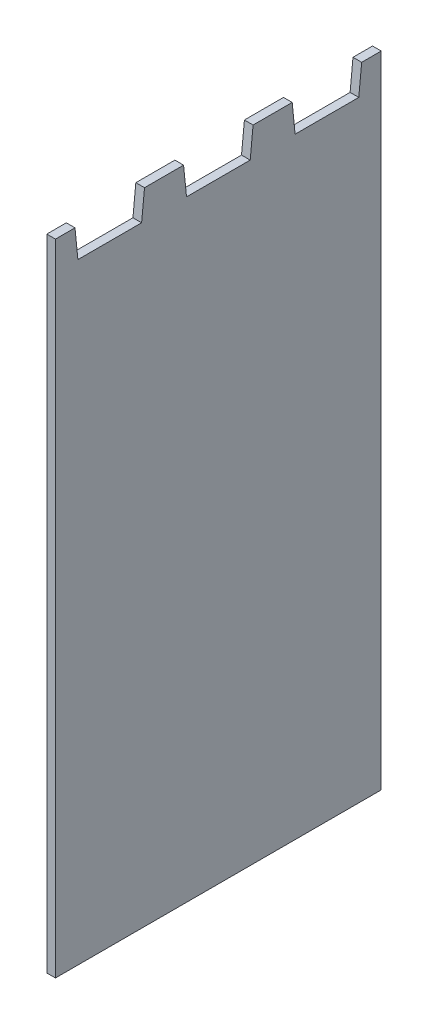
ISO-10303-21;
HEADER;
FILE_DESCRIPTION(('STEP AP214'),'2;1');
FILE_NAME('part.step','',(''),(''),'','','');
FILE_SCHEMA(('AUTOMOTIVE_DESIGN { 1 0 10303 214 1 1 1 1 }'));
ENDSEC;
DATA;
#1=APPLICATION_CONTEXT('core data for automotive mechanical design processes');
#2=APPLICATION_PROTOCOL_DEFINITION('international standard','automotive_design',2000,#1);
#3=PRODUCT_CONTEXT('',#1,'mechanical');
#4=PRODUCT('Part','Part','',(#3));
#5=PRODUCT_RELATED_PRODUCT_CATEGORY('part','',(#4));
#6=PRODUCT_DEFINITION_FORMATION('','',#4);
#7=PRODUCT_DEFINITION_CONTEXT('part definition',#1,'design');
#8=PRODUCT_DEFINITION('design','',#6,#7);
#9=PRODUCT_DEFINITION_SHAPE('','',#8);
#10=(LENGTH_UNIT() NAMED_UNIT(*) SI_UNIT(.MILLI.,.METRE.));
#11=(NAMED_UNIT(*) PLANE_ANGLE_UNIT() SI_UNIT($,.RADIAN.));
#12=(NAMED_UNIT(*) SI_UNIT($,.STERADIAN.) SOLID_ANGLE_UNIT());
#13=UNCERTAINTY_MEASURE_WITH_UNIT(LENGTH_MEASURE(1.E-05),#10,'distance_accuracy_value','');
#14=(GEOMETRIC_REPRESENTATION_CONTEXT(3) GLOBAL_UNCERTAINTY_ASSIGNED_CONTEXT((#13)) GLOBAL_UNIT_ASSIGNED_CONTEXT((#10,
#11,#12)) REPRESENTATION_CONTEXT('',''));
#15=CARTESIAN_POINT('',(0.,0.,0.));
#16=DIRECTION('',(0.,0.,1.));
#17=DIRECTION('',(1.,0.,0.));
#18=AXIS2_PLACEMENT_3D('',#15,#16,#17);
#19=CARTESIAN_POINT('',(3.,-103.,0.));
#20=DIRECTION('',(0.,1.,0.));
#21=DIRECTION('',(0.,0.,1.));
#22=AXIS2_PLACEMENT_3D('',#19,#20,#21);
#23=PLANE('',#22);
#24=DIRECTION('',(0.,0.,-1.));
#25=VECTOR('',#24,1.);
#26=CARTESIAN_POINT('',(0.,-103.,0.));
#27=LINE('',#26,#25);
#28=CARTESIAN_POINT('',(0.,-103.,93.75));
#29=VERTEX_POINT('',#28);
#30=CARTESIAN_POINT('',(0.,-103.,-18.75));
#31=VERTEX_POINT('',#30);
#32=EDGE_CURVE('E124',#29,#31,#27,.T.);
#33=ORIENTED_EDGE('',*,*,#32,.T.);
#34=DIRECTION('',(-1.,0.,0.));
#35=VECTOR('',#34,1.);
#36=CARTESIAN_POINT('',(3.,-103.,-18.75));
#37=LINE('',#36,#35);
#38=CARTESIAN_POINT('',(3.,-103.,-18.75));
#39=VERTEX_POINT('',#38);
#40=EDGE_CURVE('E11',#39,#31,#37,.T.);
#41=ORIENTED_EDGE('',*,*,#40,.F.);
#42=DIRECTION('',(0.,0.,-1.));
#43=VECTOR('',#42,1.);
#44=CARTESIAN_POINT('',(3.,-103.,0.));
#45=LINE('',#44,#43);
#46=CARTESIAN_POINT('',(3.,-103.,93.75));
#47=VERTEX_POINT('',#46);
#48=EDGE_CURVE('E143',#47,#39,#45,.T.);
#49=ORIENTED_EDGE('',*,*,#48,.F.);
#50=DIRECTION('',(-1.,0.,0.));
#51=VECTOR('',#50,1.);
#52=CARTESIAN_POINT('',(3.,-103.,93.75));
#53=LINE('',#52,#51);
#54=EDGE_CURVE('E174',#47,#29,#53,.T.);
#55=ORIENTED_EDGE('',*,*,#54,.T.);
#56=EDGE_LOOP('',(#33,#41,#49,#55));
#57=FACE_BOUND('',#56,.T.);
#58=ADVANCED_FACE('F35',(#57),#23,.F.);
#59=CARTESIAN_POINT('',(3.,0.,-18.75));
#60=DIRECTION('',(0.,0.,1.));
#61=DIRECTION('',(1.,0.,0.));
#62=AXIS2_PLACEMENT_3D('',#59,#60,#61);
#63=PLANE('',#62);
#64=DIRECTION('',(0.,1.,0.));
#65=VECTOR('',#64,1.);
#66=CARTESIAN_POINT('',(0.,0.,-18.75));
#67=LINE('',#66,#65);
#68=CARTESIAN_POINT('',(0.,118.,-18.75));
#69=VERTEX_POINT('',#68);
#70=EDGE_CURVE('E127',#31,#69,#67,.T.);
#71=ORIENTED_EDGE('',*,*,#70,.T.);
#72=DIRECTION('',(-1.,0.,0.));
#73=VECTOR('',#72,1.);
#74=CARTESIAN_POINT('',(3.,118.,-18.75));
#75=LINE('',#74,#73);
#76=CARTESIAN_POINT('',(3.,118.,-18.75));
#77=VERTEX_POINT('',#76);
#78=EDGE_CURVE('E43',#77,#69,#75,.T.);
#79=ORIENTED_EDGE('',*,*,#78,.F.);
#80=DIRECTION('',(0.,1.,0.));
#81=VECTOR('',#80,1.);
#82=CARTESIAN_POINT('',(3.,0.,-18.75));
#83=LINE('',#82,#81);
#84=EDGE_CURVE('E84',#39,#77,#83,.T.);
#85=ORIENTED_EDGE('',*,*,#84,.F.);
#86=ORIENTED_EDGE('',*,*,#40,.T.);
#87=EDGE_LOOP('',(#71,#79,#85,#86));
#88=FACE_BOUND('',#87,.T.);
#89=ADVANCED_FACE('F149',(#88),#63,.F.);
#90=CARTESIAN_POINT('',(3.,118.,0.));
#91=DIRECTION('',(0.,1.,0.));
#92=DIRECTION('',(0.,0.,1.));
#93=AXIS2_PLACEMENT_3D('',#90,#91,#92);
#94=PLANE('',#93);
#95=DIRECTION('',(0.,0.,-1.));
#96=VECTOR('',#95,1.);
#97=CARTESIAN_POINT('',(0.,118.,0.));
#98=LINE('',#97,#96);
#99=CARTESIAN_POINT('',(0.,118.,-12.));
#100=VERTEX_POINT('',#99);
#101=EDGE_CURVE('E131',#100,#69,#98,.T.);
#102=ORIENTED_EDGE('',*,*,#101,.F.);
#103=DIRECTION('',(-1.,0.,0.));
#104=VECTOR('',#103,1.);
#105=CARTESIAN_POINT('',(3.,118.,-12.));
#106=LINE('',#105,#104);
#107=CARTESIAN_POINT('',(3.,118.,-12.));
#108=VERTEX_POINT('',#107);
#109=EDGE_CURVE('E106',#108,#100,#106,.T.);
#110=ORIENTED_EDGE('',*,*,#109,.F.);
#111=DIRECTION('',(0.,0.,-1.));
#112=VECTOR('',#111,1.);
#113=CARTESIAN_POINT('',(3.,118.,0.));
#114=LINE('',#113,#112);
#115=EDGE_CURVE('E114',#108,#77,#114,.T.);
#116=ORIENTED_EDGE('',*,*,#115,.T.);
#117=ORIENTED_EDGE('',*,*,#78,.T.);
#118=EDGE_LOOP('',(#102,#110,#116,#117));
#119=FACE_BOUND('',#118,.T.);
#120=ADVANCED_FACE('F148',(#119),#94,.T.);
#121=CARTESIAN_POINT('',(3.,-0.0198019801980195,-0.198019801980195));
#122=DIRECTION('',(0.,0.0995037190209989,0.995037190209989));
#123=DIRECTION('',(0.,-0.995037190209989,0.0995037190209989));
#124=AXIS2_PLACEMENT_3D('',#121,#122,#123);
#125=PLANE('',#124);
#126=DIRECTION('',(0.,0.995037190209989,-0.0995037190209989));
#127=VECTOR('',#126,1.);
#128=CARTESIAN_POINT('',(0.,-0.0198019801980195,-0.198019801980195));
#129=LINE('',#128,#127);
#130=CARTESIAN_POINT('',(0.,108.,-11.));
#131=VERTEX_POINT('',#130);
#132=EDGE_CURVE('E102',#131,#100,#129,.T.);
#133=ORIENTED_EDGE('',*,*,#132,.F.);
#134=DIRECTION('',(-1.,0.,0.));
#135=VECTOR('',#134,1.);
#136=CARTESIAN_POINT('',(3.,108.,-11.));
#137=LINE('',#136,#135);
#138=CARTESIAN_POINT('',(3.,108.,-11.));
#139=VERTEX_POINT('',#138);
#140=EDGE_CURVE('E97',#139,#131,#137,.T.);
#141=ORIENTED_EDGE('',*,*,#140,.F.);
#142=DIRECTION('',(0.,0.995037190209989,-0.0995037190209989));
#143=VECTOR('',#142,1.);
#144=CARTESIAN_POINT('',(3.,-0.0198019801980195,-0.198019801980195));
#145=LINE('',#144,#143);
#146=EDGE_CURVE('E100',#139,#108,#145,.T.);
#147=ORIENTED_EDGE('',*,*,#146,.T.);
#148=ORIENTED_EDGE('',*,*,#109,.T.);
#149=EDGE_LOOP('',(#133,#141,#147,#148));
#150=FACE_BOUND('',#149,.T.);
#151=ADVANCED_FACE('F99',(#150),#125,.T.);
#152=CARTESIAN_POINT('',(3.,108.,0.));
#153=DIRECTION('',(0.,1.,0.));
#154=DIRECTION('',(0.,0.,1.));
#155=AXIS2_PLACEMENT_3D('',#152,#153,#154);
#156=PLANE('',#155);
#157=DIRECTION('',(0.,0.,-1.));
#158=VECTOR('',#157,1.);
#159=CARTESIAN_POINT('',(0.,108.,0.));
#160=LINE('',#159,#158);
#161=CARTESIAN_POINT('',(0.,108.,11.));
#162=VERTEX_POINT('',#161);
#163=EDGE_CURVE('E135',#162,#131,#160,.T.);
#164=ORIENTED_EDGE('',*,*,#163,.F.);
#165=DIRECTION('',(-1.,0.,0.));
#166=VECTOR('',#165,1.);
#167=CARTESIAN_POINT('',(3.,108.,11.));
#168=LINE('',#167,#166);
#169=CARTESIAN_POINT('',(3.,108.,11.));
#170=VERTEX_POINT('',#169);
#171=EDGE_CURVE('E72',#170,#162,#168,.T.);
#172=ORIENTED_EDGE('',*,*,#171,.F.);
#173=DIRECTION('',(0.,0.,-1.));
#174=VECTOR('',#173,1.);
#175=CARTESIAN_POINT('',(3.,108.,0.));
#176=LINE('',#175,#174);
#177=EDGE_CURVE('E112',#170,#139,#176,.T.);
#178=ORIENTED_EDGE('',*,*,#177,.T.);
#179=ORIENTED_EDGE('',*,*,#140,.T.);
#180=EDGE_LOOP('',(#164,#172,#178,#179));
#181=FACE_BOUND('',#180,.T.);
#182=ADVANCED_FACE('F116',(#181),#156,.T.);
#183=CARTESIAN_POINT('',(3.,-0.0198019801980129,0.198019801980127));
#184=DIRECTION('',(0.,0.0995037190209996,-0.995037190209989));
#185=DIRECTION('',(0.,0.995037190209989,0.0995037190209996));
#186=AXIS2_PLACEMENT_3D('',#183,#184,#185);
#187=PLANE('',#186);
#188=DIRECTION('',(0.,-0.995037190209989,-0.0995037190209996));
#189=VECTOR('',#188,1.);
#190=CARTESIAN_POINT('',(0.,-0.0198019801980129,0.198019801980127));
#191=LINE('',#190,#189);
#192=CARTESIAN_POINT('',(0.,118.,12.));
#193=VERTEX_POINT('',#192);
#194=EDGE_CURVE('E137',#193,#162,#191,.T.);
#195=ORIENTED_EDGE('',*,*,#194,.F.);
#196=DIRECTION('',(-1.,0.,0.));
#197=VECTOR('',#196,1.);
#198=CARTESIAN_POINT('',(3.,118.,12.));
#199=LINE('',#198,#197);
#200=CARTESIAN_POINT('',(3.,118.,12.));
#201=VERTEX_POINT('',#200);
#202=EDGE_CURVE('E51',#201,#193,#199,.T.);
#203=ORIENTED_EDGE('',*,*,#202,.F.);
#204=DIRECTION('',(0.,-0.995037190209989,-0.0995037190209996));
#205=VECTOR('',#204,1.);
#206=CARTESIAN_POINT('',(3.,-0.0198019801980129,0.198019801980127));
#207=LINE('',#206,#205);
#208=EDGE_CURVE('E117',#201,#170,#207,.T.);
#209=ORIENTED_EDGE('',*,*,#208,.T.);
#210=ORIENTED_EDGE('',*,*,#171,.T.);
#211=EDGE_LOOP('',(#195,#203,#209,#210));
#212=FACE_BOUND('',#211,.T.);
#213=ADVANCED_FACE('F155',(#212),#187,.T.);
#214=CARTESIAN_POINT('',(3.,118.,0.));
#215=DIRECTION('',(0.,1.,0.));
#216=DIRECTION('',(0.,0.,1.));
#217=AXIS2_PLACEMENT_3D('',#214,#215,#216);
#218=PLANE('',#217);
#219=DIRECTION('',(0.,0.,-1.));
#220=VECTOR('',#219,1.);
#221=CARTESIAN_POINT('',(0.,118.,0.));
#222=LINE('',#221,#220);
#223=CARTESIAN_POINT('',(0.,118.,25.5));
#224=VERTEX_POINT('',#223);
#225=EDGE_CURVE('E140',#224,#193,#222,.T.);
#226=ORIENTED_EDGE('',*,*,#225,.F.);
#227=DIRECTION('',(-1.,0.,0.));
#228=VECTOR('',#227,1.);
#229=CARTESIAN_POINT('',(3.,118.,25.5));
#230=LINE('',#229,#228);
#231=CARTESIAN_POINT('',(3.,118.,25.5));
#232=VERTEX_POINT('',#231);
#233=EDGE_CURVE('E128',#232,#224,#230,.T.);
#234=ORIENTED_EDGE('',*,*,#233,.F.);
#235=DIRECTION('',(0.,0.,-1.));
#236=VECTOR('',#235,1.);
#237=CARTESIAN_POINT('',(3.,118.,0.));
#238=LINE('',#237,#236);
#239=EDGE_CURVE('E119',#232,#201,#238,.T.);
#240=ORIENTED_EDGE('',*,*,#239,.T.);
#241=ORIENTED_EDGE('',*,*,#202,.T.);
#242=EDGE_LOOP('',(#226,#234,#240,#241));
#243=FACE_BOUND('',#242,.T.);
#244=ADVANCED_FACE('F157',(#243),#218,.T.);
#245=CARTESIAN_POINT('',(3.,0.,0.));
#246=DIRECTION('',(1.,0.,0.));
#247=DIRECTION('',(0.,0.,-1.));
#248=AXIS2_PLACEMENT_3D('',#245,#246,#247);
#249=PLANE('',#248);
#250=ORIENTED_EDGE('',*,*,#48,.T.);
#251=ORIENTED_EDGE('',*,*,#84,.T.);
#252=ORIENTED_EDGE('',*,*,#115,.F.);
#253=ORIENTED_EDGE('',*,*,#146,.F.);
#254=ORIENTED_EDGE('',*,*,#177,.F.);
#255=ORIENTED_EDGE('',*,*,#208,.F.);
#256=ORIENTED_EDGE('',*,*,#239,.F.);
#257=DIRECTION('',(0.,0.995037190209989,-0.0995037190209989));
#258=VECTOR('',#257,1.);
#259=CARTESIAN_POINT('',(3.,-0.0198019801980195,37.3019801980198));
#260=LINE('',#259,#258);
#261=CARTESIAN_POINT('',(3.,108.,26.5));
#262=VERTEX_POINT('',#261);
#263=EDGE_CURVE('E237',#262,#232,#260,.T.);
#264=ORIENTED_EDGE('',*,*,#263,.F.);
#265=DIRECTION('',(0.,0.,-1.));
#266=VECTOR('',#265,1.);
#267=CARTESIAN_POINT('',(3.,108.,37.5));
#268=LINE('',#267,#266);
#269=CARTESIAN_POINT('',(3.,108.,48.5));
#270=VERTEX_POINT('',#269);
#271=EDGE_CURVE('E240',#270,#262,#268,.T.);
#272=ORIENTED_EDGE('',*,*,#271,.F.);
#273=DIRECTION('',(0.,-0.995037190209989,-0.0995037190209996));
#274=VECTOR('',#273,1.);
#275=CARTESIAN_POINT('',(3.,-0.0198019801980129,37.6980198019801));
#276=LINE('',#275,#274);
#277=CARTESIAN_POINT('',(3.,118.,49.5));
#278=VERTEX_POINT('',#277);
#279=EDGE_CURVE('E280',#278,#270,#276,.T.);
#280=ORIENTED_EDGE('',*,*,#279,.F.);
#281=DIRECTION('',(0.,0.,-1.));
#282=VECTOR('',#281,1.);
#283=CARTESIAN_POINT('',(3.,118.,37.5));
#284=LINE('',#283,#282);
#285=CARTESIAN_POINT('',(3.,118.,63.));
#286=VERTEX_POINT('',#285);
#287=EDGE_CURVE('E224',#286,#278,#284,.T.);
#288=ORIENTED_EDGE('',*,*,#287,.F.);
#289=DIRECTION('',(0.,0.995037190209989,-0.0995037190209989));
#290=VECTOR('',#289,1.);
#291=CARTESIAN_POINT('',(3.,-0.0198019801980195,74.8019801980198));
#292=LINE('',#291,#290);
#293=CARTESIAN_POINT('',(3.,108.,64.));
#294=VERTEX_POINT('',#293);
#295=EDGE_CURVE('E294',#294,#286,#292,.T.);
#296=ORIENTED_EDGE('',*,*,#295,.F.);
#297=DIRECTION('',(0.,0.,-1.));
#298=VECTOR('',#297,1.);
#299=CARTESIAN_POINT('',(3.,108.,75.));
#300=LINE('',#299,#298);
#301=CARTESIAN_POINT('',(3.,108.,86.));
#302=VERTEX_POINT('',#301);
#303=EDGE_CURVE('E299',#302,#294,#300,.T.);
#304=ORIENTED_EDGE('',*,*,#303,.F.);
#305=DIRECTION('',(0.,-0.995037190209989,-0.0995037190209996));
#306=VECTOR('',#305,1.);
#307=CARTESIAN_POINT('',(3.,-0.0198019801980129,75.1980198019801));
#308=LINE('',#307,#306);
#309=CARTESIAN_POINT('',(3.,118.,87.));
#310=VERTEX_POINT('',#309);
#311=EDGE_CURVE('E301',#310,#302,#308,.T.);
#312=ORIENTED_EDGE('',*,*,#311,.F.);
#313=DIRECTION('',(0.,0.,-1.));
#314=VECTOR('',#313,1.);
#315=CARTESIAN_POINT('',(3.,118.,75.));
#316=LINE('',#315,#314);
#317=CARTESIAN_POINT('',(3.,118.,93.75));
#318=VERTEX_POINT('',#317);
#319=EDGE_CURVE('E262',#318,#310,#316,.T.);
#320=ORIENTED_EDGE('',*,*,#319,.F.);
#321=DIRECTION('',(0.,1.,0.));
#322=VECTOR('',#321,1.);
#323=CARTESIAN_POINT('',(3.,0.,93.75));
#324=LINE('',#323,#322);
#325=EDGE_CURVE('E253',#47,#318,#324,.T.);
#326=ORIENTED_EDGE('',*,*,#325,.F.);
#327=EDGE_LOOP('',(#250,#251,#252,#253,#254,#255,#256,#264,#272,#280,#288,#296,#304,#312,#320,#326));
#328=FACE_BOUND('',#327,.T.);
#329=ADVANCED_FACE('F111',(#328),#249,.T.);
#330=CARTESIAN_POINT('',(0.,0.,0.));
#331=DIRECTION('',(1.,0.,0.));
#332=DIRECTION('',(0.,0.,-1.));
#333=AXIS2_PLACEMENT_3D('',#330,#331,#332);
#334=PLANE('',#333);
#335=ORIENTED_EDGE('',*,*,#32,.F.);
#336=DIRECTION('',(0.,1.,0.));
#337=VECTOR('',#336,1.);
#338=CARTESIAN_POINT('',(0.,0.,93.75));
#339=LINE('',#338,#337);
#340=CARTESIAN_POINT('',(0.,118.,93.75));
#341=VERTEX_POINT('',#340);
#342=EDGE_CURVE('E179',#29,#341,#339,.T.);
#343=ORIENTED_EDGE('',*,*,#342,.T.);
#344=DIRECTION('',(0.,0.,-1.));
#345=VECTOR('',#344,1.);
#346=CARTESIAN_POINT('',(0.,118.,75.));
#347=LINE('',#346,#345);
#348=CARTESIAN_POINT('',(0.,118.,87.));
#349=VERTEX_POINT('',#348);
#350=EDGE_CURVE('E303',#341,#349,#347,.T.);
#351=ORIENTED_EDGE('',*,*,#350,.T.);
#352=DIRECTION('',(0.,-0.995037190209989,-0.0995037190209996));
#353=VECTOR('',#352,1.);
#354=CARTESIAN_POINT('',(0.,-0.0198019801980129,75.1980198019801));
#355=LINE('',#354,#353);
#356=CARTESIAN_POINT('',(0.,108.,86.));
#357=VERTEX_POINT('',#356);
#358=EDGE_CURVE('E312',#349,#357,#355,.T.);
#359=ORIENTED_EDGE('',*,*,#358,.T.);
#360=DIRECTION('',(0.,0.,-1.));
#361=VECTOR('',#360,1.);
#362=CARTESIAN_POINT('',(0.,108.,75.));
#363=LINE('',#362,#361);
#364=CARTESIAN_POINT('',(0.,108.,64.));
#365=VERTEX_POINT('',#364);
#366=EDGE_CURVE('E310',#357,#365,#363,.T.);
#367=ORIENTED_EDGE('',*,*,#366,.T.);
#368=DIRECTION('',(0.,0.995037190209989,-0.0995037190209989));
#369=VECTOR('',#368,1.);
#370=CARTESIAN_POINT('',(0.,-0.0198019801980195,74.8019801980198));
#371=LINE('',#370,#369);
#372=CARTESIAN_POINT('',(0.,118.,63.));
#373=VERTEX_POINT('',#372);
#374=EDGE_CURVE('E236',#365,#373,#371,.T.);
#375=ORIENTED_EDGE('',*,*,#374,.T.);
#376=DIRECTION('',(0.,0.,-1.));
#377=VECTOR('',#376,1.);
#378=CARTESIAN_POINT('',(0.,118.,37.5));
#379=LINE('',#378,#377);
#380=CARTESIAN_POINT('',(0.,118.,49.5));
#381=VERTEX_POINT('',#380);
#382=EDGE_CURVE('E222',#373,#381,#379,.T.);
#383=ORIENTED_EDGE('',*,*,#382,.T.);
#384=DIRECTION('',(0.,-0.995037190209989,-0.0995037190209996));
#385=VECTOR('',#384,1.);
#386=CARTESIAN_POINT('',(0.,-0.0198019801980129,37.6980198019801));
#387=LINE('',#386,#385);
#388=CARTESIAN_POINT('',(0.,108.,48.5));
#389=VERTEX_POINT('',#388);
#390=EDGE_CURVE('E228',#381,#389,#387,.T.);
#391=ORIENTED_EDGE('',*,*,#390,.T.);
#392=DIRECTION('',(0.,0.,-1.));
#393=VECTOR('',#392,1.);
#394=CARTESIAN_POINT('',(0.,108.,37.5));
#395=LINE('',#394,#393);
#396=CARTESIAN_POINT('',(0.,108.,26.5));
#397=VERTEX_POINT('',#396);
#398=EDGE_CURVE('E231',#389,#397,#395,.T.);
#399=ORIENTED_EDGE('',*,*,#398,.T.);
#400=DIRECTION('',(0.,0.995037190209989,-0.0995037190209989));
#401=VECTOR('',#400,1.);
#402=CARTESIAN_POINT('',(0.,-0.0198019801980195,37.3019801980198));
#403=LINE('',#402,#401);
#404=EDGE_CURVE('E276',#397,#224,#403,.T.);
#405=ORIENTED_EDGE('',*,*,#404,.T.);
#406=ORIENTED_EDGE('',*,*,#225,.T.);
#407=ORIENTED_EDGE('',*,*,#194,.T.);
#408=ORIENTED_EDGE('',*,*,#163,.T.);
#409=ORIENTED_EDGE('',*,*,#132,.T.);
#410=ORIENTED_EDGE('',*,*,#101,.T.);
#411=ORIENTED_EDGE('',*,*,#70,.F.);
#412=EDGE_LOOP('',(#335,#343,#351,#359,#367,#375,#383,#391,#399,#405,#406,#407,#408,#409,#410,#411));
#413=FACE_BOUND('',#412,.T.);
#414=ADVANCED_FACE('F153',(#413),#334,.F.);
#415=CARTESIAN_POINT('',(3.,-0.0198019801980195,37.3019801980198));
#416=DIRECTION('',(0.,0.0995037190209989,0.995037190209989));
#417=DIRECTION('',(0.,-0.995037190209989,0.0995037190209989));
#418=AXIS2_PLACEMENT_3D('',#415,#416,#417);
#419=PLANE('',#418);
#420=ORIENTED_EDGE('',*,*,#404,.F.);
#421=DIRECTION('',(-1.,0.,0.));
#422=VECTOR('',#421,1.);
#423=CARTESIAN_POINT('',(3.,108.,26.5));
#424=LINE('',#423,#422);
#425=EDGE_CURVE('E245',#262,#397,#424,.T.);
#426=ORIENTED_EDGE('',*,*,#425,.F.);
#427=ORIENTED_EDGE('',*,*,#263,.T.);
#428=ORIENTED_EDGE('',*,*,#233,.T.);
#429=EDGE_LOOP('',(#420,#426,#427,#428));
#430=FACE_BOUND('',#429,.T.);
#431=ADVANCED_FACE('F289',(#430),#419,.T.);
#432=CARTESIAN_POINT('',(3.,108.,37.5));
#433=DIRECTION('',(0.,1.,0.));
#434=DIRECTION('',(0.,0.,1.));
#435=AXIS2_PLACEMENT_3D('',#432,#433,#434);
#436=PLANE('',#435);
#437=ORIENTED_EDGE('',*,*,#398,.F.);
#438=DIRECTION('',(-1.,0.,0.));
#439=VECTOR('',#438,1.);
#440=CARTESIAN_POINT('',(3.,108.,48.5));
#441=LINE('',#440,#439);
#442=EDGE_CURVE('E211',#270,#389,#441,.T.);
#443=ORIENTED_EDGE('',*,*,#442,.F.);
#444=ORIENTED_EDGE('',*,*,#271,.T.);
#445=ORIENTED_EDGE('',*,*,#425,.T.);
#446=EDGE_LOOP('',(#437,#443,#444,#445));
#447=FACE_BOUND('',#446,.T.);
#448=ADVANCED_FACE('F285',(#447),#436,.T.);
#449=CARTESIAN_POINT('',(3.,-0.0198019801980129,37.6980198019801));
#450=DIRECTION('',(0.,0.0995037190209996,-0.995037190209989));
#451=DIRECTION('',(0.,0.995037190209989,0.0995037190209996));
#452=AXIS2_PLACEMENT_3D('',#449,#450,#451);
#453=PLANE('',#452);
#454=ORIENTED_EDGE('',*,*,#390,.F.);
#455=DIRECTION('',(-1.,0.,0.));
#456=VECTOR('',#455,1.);
#457=CARTESIAN_POINT('',(3.,118.,49.5));
#458=LINE('',#457,#456);
#459=EDGE_CURVE('E217',#278,#381,#458,.T.);
#460=ORIENTED_EDGE('',*,*,#459,.F.);
#461=ORIENTED_EDGE('',*,*,#279,.T.);
#462=ORIENTED_EDGE('',*,*,#442,.T.);
#463=EDGE_LOOP('',(#454,#460,#461,#462));
#464=FACE_BOUND('',#463,.T.);
#465=ADVANCED_FACE('F229',(#464),#453,.T.);
#466=CARTESIAN_POINT('',(3.,118.,37.5));
#467=DIRECTION('',(0.,1.,0.));
#468=DIRECTION('',(0.,0.,1.));
#469=AXIS2_PLACEMENT_3D('',#466,#467,#468);
#470=PLANE('',#469);
#471=ORIENTED_EDGE('',*,*,#382,.F.);
#472=DIRECTION('',(-1.,0.,0.));
#473=VECTOR('',#472,1.);
#474=CARTESIAN_POINT('',(3.,118.,63.));
#475=LINE('',#474,#473);
#476=EDGE_CURVE('E275',#286,#373,#475,.T.);
#477=ORIENTED_EDGE('',*,*,#476,.F.);
#478=ORIENTED_EDGE('',*,*,#287,.T.);
#479=ORIENTED_EDGE('',*,*,#459,.T.);
#480=EDGE_LOOP('',(#471,#477,#478,#479));
#481=FACE_BOUND('',#480,.T.);
#482=ADVANCED_FACE('F218',(#481),#470,.T.);
#483=CARTESIAN_POINT('',(3.,-0.0198019801980195,74.8019801980198));
#484=DIRECTION('',(0.,0.0995037190209989,0.995037190209989));
#485=DIRECTION('',(0.,-0.995037190209989,0.0995037190209989));
#486=AXIS2_PLACEMENT_3D('',#483,#484,#485);
#487=PLANE('',#486);
#488=ORIENTED_EDGE('',*,*,#374,.F.);
#489=DIRECTION('',(-1.,0.,0.));
#490=VECTOR('',#489,1.);
#491=CARTESIAN_POINT('',(3.,108.,64.));
#492=LINE('',#491,#490);
#493=EDGE_CURVE('E272',#294,#365,#492,.T.);
#494=ORIENTED_EDGE('',*,*,#493,.F.);
#495=ORIENTED_EDGE('',*,*,#295,.T.);
#496=ORIENTED_EDGE('',*,*,#476,.T.);
#497=EDGE_LOOP('',(#488,#494,#495,#496));
#498=FACE_BOUND('',#497,.T.);
#499=ADVANCED_FACE('F298',(#498),#487,.T.);
#500=CARTESIAN_POINT('',(3.,108.,75.));
#501=DIRECTION('',(0.,1.,0.));
#502=DIRECTION('',(0.,0.,1.));
#503=AXIS2_PLACEMENT_3D('',#500,#501,#502);
#504=PLANE('',#503);
#505=ORIENTED_EDGE('',*,*,#366,.F.);
#506=DIRECTION('',(-1.,0.,0.));
#507=VECTOR('',#506,1.);
#508=CARTESIAN_POINT('',(3.,108.,86.));
#509=LINE('',#508,#507);
#510=EDGE_CURVE('E269',#302,#357,#509,.T.);
#511=ORIENTED_EDGE('',*,*,#510,.F.);
#512=ORIENTED_EDGE('',*,*,#303,.T.);
#513=ORIENTED_EDGE('',*,*,#493,.T.);
#514=EDGE_LOOP('',(#505,#511,#512,#513));
#515=FACE_BOUND('',#514,.T.);
#516=ADVANCED_FACE('F331',(#515),#504,.T.);
#517=CARTESIAN_POINT('',(3.,-0.0198019801980129,75.1980198019801));
#518=DIRECTION('',(0.,0.0995037190209996,-0.995037190209989));
#519=DIRECTION('',(0.,0.995037190209989,0.0995037190209996));
#520=AXIS2_PLACEMENT_3D('',#517,#518,#519);
#521=PLANE('',#520);
#522=ORIENTED_EDGE('',*,*,#358,.F.);
#523=DIRECTION('',(-1.,0.,0.));
#524=VECTOR('',#523,1.);
#525=CARTESIAN_POINT('',(3.,118.,87.));
#526=LINE('',#525,#524);
#527=EDGE_CURVE('E260',#310,#349,#526,.T.);
#528=ORIENTED_EDGE('',*,*,#527,.F.);
#529=ORIENTED_EDGE('',*,*,#311,.T.);
#530=ORIENTED_EDGE('',*,*,#510,.T.);
#531=EDGE_LOOP('',(#522,#528,#529,#530));
#532=FACE_BOUND('',#531,.T.);
#533=ADVANCED_FACE('F324',(#532),#521,.T.);
#534=CARTESIAN_POINT('',(3.,118.,75.));
#535=DIRECTION('',(0.,1.,0.));
#536=DIRECTION('',(0.,0.,1.));
#537=AXIS2_PLACEMENT_3D('',#534,#535,#536);
#538=PLANE('',#537);
#539=ORIENTED_EDGE('',*,*,#350,.F.);
#540=DIRECTION('',(-1.,0.,0.));
#541=VECTOR('',#540,1.);
#542=CARTESIAN_POINT('',(3.,118.,93.75));
#543=LINE('',#542,#541);
#544=EDGE_CURVE('E258',#318,#341,#543,.T.);
#545=ORIENTED_EDGE('',*,*,#544,.F.);
#546=ORIENTED_EDGE('',*,*,#319,.T.);
#547=ORIENTED_EDGE('',*,*,#527,.T.);
#548=EDGE_LOOP('',(#539,#545,#546,#547));
#549=FACE_BOUND('',#548,.T.);
#550=ADVANCED_FACE('F319',(#549),#538,.T.);
#551=CARTESIAN_POINT('',(3.,0.,93.75));
#552=DIRECTION('',(0.,0.,1.));
#553=DIRECTION('',(1.,0.,0.));
#554=AXIS2_PLACEMENT_3D('',#551,#552,#553);
#555=PLANE('',#554);
#556=ORIENTED_EDGE('',*,*,#342,.F.);
#557=ORIENTED_EDGE('',*,*,#54,.F.);
#558=ORIENTED_EDGE('',*,*,#325,.T.);
#559=ORIENTED_EDGE('',*,*,#544,.T.);
#560=EDGE_LOOP('',(#556,#557,#558,#559));
#561=FACE_BOUND('',#560,.T.);
#562=ADVANCED_FACE('F257',(#561),#555,.T.);
#563=CLOSED_SHELL('',(#58,#89,#120,#151,#182,#213,#244,#329,#414,#431,#448,#465,#482,#499,#516,
#533,#550,#562));
#564=MANIFOLD_SOLID_BREP('B2',#563);
#565=ADVANCED_BREP_SHAPE_REPRESENTATION('',(#18,#564),#14);
#566=SHAPE_DEFINITION_REPRESENTATION(#9,#565);
ENDSEC;
END-ISO-10303-21;
